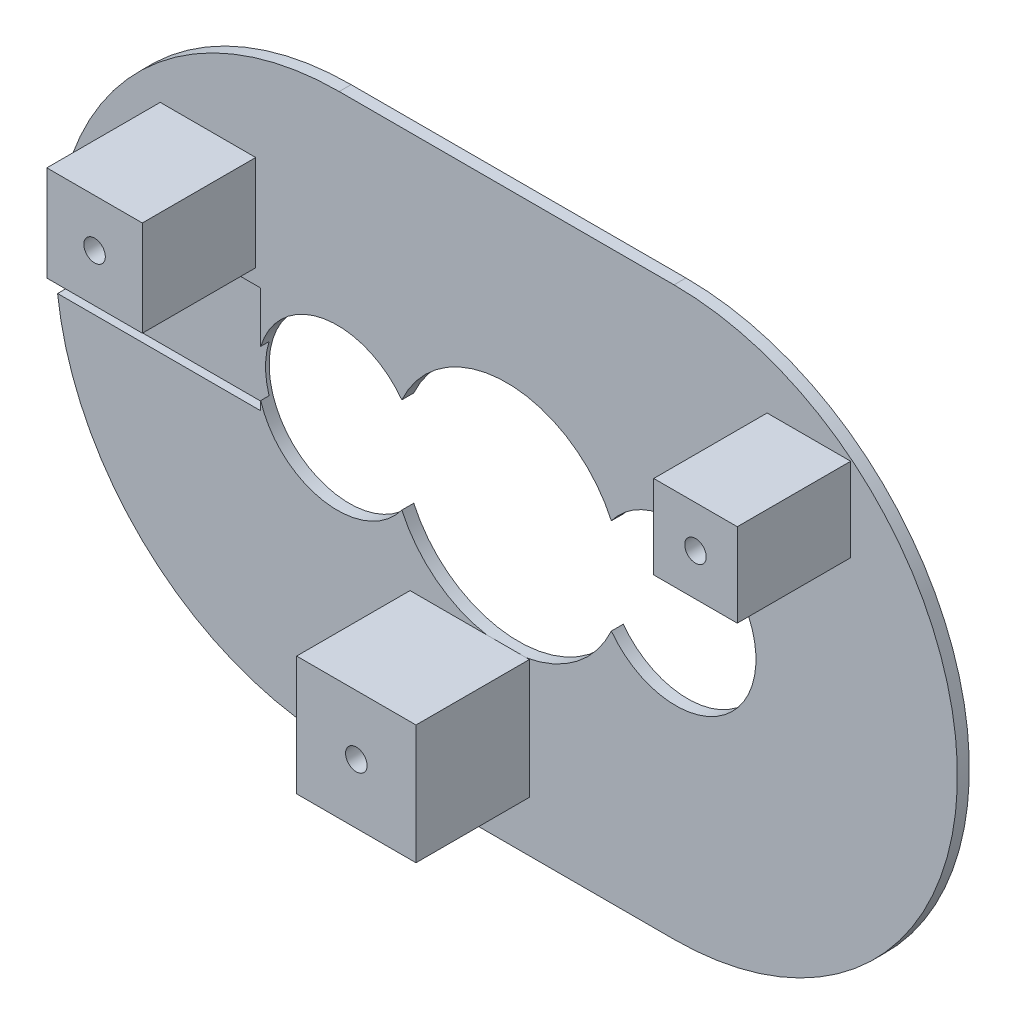
ISO-10303-21;
HEADER;
FILE_DESCRIPTION(('STEP AP214'),'2;1');
FILE_NAME('part.step','',(''),(''),'','','');
FILE_SCHEMA(('AUTOMOTIVE_DESIGN { 1 0 10303 214 1 1 1 1 }'));
ENDSEC;
DATA;
#1=APPLICATION_CONTEXT('core data for automotive mechanical design processes');
#2=APPLICATION_PROTOCOL_DEFINITION('international standard','automotive_design',2000,#1);
#3=PRODUCT_CONTEXT('',#1,'mechanical');
#4=PRODUCT('Part','Part','',(#3));
#5=PRODUCT_RELATED_PRODUCT_CATEGORY('part','',(#4));
#6=PRODUCT_DEFINITION_FORMATION('','',#4);
#7=PRODUCT_DEFINITION_CONTEXT('part definition',#1,'design');
#8=PRODUCT_DEFINITION('design','',#6,#7);
#9=PRODUCT_DEFINITION_SHAPE('','',#8);
#10=(LENGTH_UNIT() NAMED_UNIT(*) SI_UNIT(.MILLI.,.METRE.));
#11=(NAMED_UNIT(*) PLANE_ANGLE_UNIT() SI_UNIT($,.RADIAN.));
#12=(NAMED_UNIT(*) SI_UNIT($,.STERADIAN.) SOLID_ANGLE_UNIT());
#13=UNCERTAINTY_MEASURE_WITH_UNIT(LENGTH_MEASURE(1.E-05),#10,'distance_accuracy_value','');
#14=(GEOMETRIC_REPRESENTATION_CONTEXT(3) GLOBAL_UNCERTAINTY_ASSIGNED_CONTEXT((#13)) GLOBAL_UNIT_ASSIGNED_CONTEXT((#10,
#11,#12)) REPRESENTATION_CONTEXT('',''));
#15=CARTESIAN_POINT('',(0.,0.,0.));
#16=DIRECTION('',(0.,0.,1.));
#17=DIRECTION('',(1.,0.,0.));
#18=AXIS2_PLACEMENT_3D('',#15,#16,#17);
#19=CARTESIAN_POINT('',(0.,0.,1.));
#20=DIRECTION('',(0.,0.,-1.));
#21=DIRECTION('',(-1.,0.,0.));
#22=AXIS2_PLACEMENT_3D('',#19,#20,#21);
#23=CYLINDRICAL_SURFACE('',#22,9.64479785047995);
#24=DIRECTION('',(0.,0.,1.));
#25=VECTOR('',#24,1.);
#26=CARTESIAN_POINT('',(-8.7772747293281,3.99769607430594,5.25));
#27=LINE('',#26,#25);
#28=CARTESIAN_POINT('',(-8.7772747293281,3.99769607430594,0.));
#29=VERTEX_POINT('',#28);
#30=CARTESIAN_POINT('',(-8.7772747293281,3.99769607430594,1.));
#31=VERTEX_POINT('',#30);
#32=EDGE_CURVE('E215',#29,#31,#27,.T.);
#33=ORIENTED_EDGE('',*,*,#32,.F.);
#34=CARTESIAN_POINT('',(0.,0.,0.));
#35=DIRECTION('',(0.,0.,1.));
#36=DIRECTION('',(1.,0.,0.));
#37=AXIS2_PLACEMENT_3D('',#34,#35,#36);
#38=CIRCLE('',#37,9.64479785047995);
#39=CARTESIAN_POINT('',(8.77727472932787,3.99769607430645,0.));
#40=VERTEX_POINT('',#39);
#41=EDGE_CURVE('E227',#40,#29,#38,.T.);
#42=ORIENTED_EDGE('',*,*,#41,.F.);
#43=DIRECTION('',(0.,0.,1.));
#44=VECTOR('',#43,1.);
#45=CARTESIAN_POINT('',(8.77727472932786,3.99769607430645,5.25));
#46=LINE('',#45,#44);
#47=CARTESIAN_POINT('',(8.77727472932786,3.99769607430645,1.));
#48=VERTEX_POINT('',#47);
#49=EDGE_CURVE('E57',#48,#40,#46,.F.);
#50=ORIENTED_EDGE('',*,*,#49,.F.);
#51=CARTESIAN_POINT('',(0.,0.,1.));
#52=DIRECTION('',(0.,0.,1.));
#53=DIRECTION('',(1.,0.,0.));
#54=AXIS2_PLACEMENT_3D('',#51,#52,#53);
#55=CIRCLE('',#54,9.64479785047995);
#56=EDGE_CURVE('E229',#48,#31,#55,.T.);
#57=ORIENTED_EDGE('',*,*,#56,.T.);
#58=EDGE_LOOP('',(#33,#42,#50,#57));
#59=FACE_BOUND('',#58,.T.);
#60=ADVANCED_FACE('F35',(#59),#23,.F.);
#61=CARTESIAN_POINT('',(-20.6,-2.70527352282265,0.3));
#62=DIRECTION('',(1.,0.,0.));
#63=DIRECTION('',(0.,0.,-1.));
#64=AXIS2_PLACEMENT_3D('',#61,#62,#63);
#65=PLANE('',#64);
#66=DIRECTION('',(0.,1.,0.));
#67=VECTOR('',#66,1.);
#68=CARTESIAN_POINT('',(-20.6,-2.70527352282265,0.3));
#69=LINE('',#68,#67);
#70=CARTESIAN_POINT('',(-20.6,1.96488782201215,0.3));
#71=VERTEX_POINT('',#70);
#72=CARTESIAN_POINT('',(-20.6,6.2,0.3));
#73=VERTEX_POINT('',#72);
#74=EDGE_CURVE('E382',#71,#73,#69,.T.);
#75=ORIENTED_EDGE('',*,*,#74,.F.);
#76=DIRECTION('',(0.,0.,1.));
#77=VECTOR('',#76,1.);
#78=CARTESIAN_POINT('',(-20.6,1.96488782201215,0.));
#79=LINE('',#78,#77);
#80=CARTESIAN_POINT('',(-20.6,1.96488782201215,1.));
#81=VERTEX_POINT('',#80);
#82=EDGE_CURVE('E49',#71,#81,#79,.T.);
#83=ORIENTED_EDGE('',*,*,#82,.T.);
#84=DIRECTION('',(0.,1.,0.));
#85=VECTOR('',#84,1.);
#86=CARTESIAN_POINT('',(-20.6,-2.70527352282265,1.));
#87=LINE('',#86,#85);
#88=CARTESIAN_POINT('',(-20.6,6.2,1.));
#89=VERTEX_POINT('',#88);
#90=EDGE_CURVE('E388',#81,#89,#87,.T.);
#91=ORIENTED_EDGE('',*,*,#90,.T.);
#92=DIRECTION('',(0.,0.,1.));
#93=VECTOR('',#92,1.);
#94=CARTESIAN_POINT('',(-20.6,6.2,0.3));
#95=LINE('',#94,#93);
#96=EDGE_CURVE('E369',#73,#89,#95,.T.);
#97=ORIENTED_EDGE('',*,*,#96,.F.);
#98=EDGE_LOOP('',(#75,#83,#91,#97));
#99=FACE_BOUND('',#98,.T.);
#100=ADVANCED_FACE('F462',(#99),#65,.F.);
#101=CARTESIAN_POINT('',(0.,0.,1.));
#102=DIRECTION('',(0.,0.,1.));
#103=DIRECTION('',(1.,0.,0.));
#104=AXIS2_PLACEMENT_3D('',#101,#102,#103);
#105=PLANE('',#104);
#106=CARTESIAN_POINT('',(-14.1760317905712,0.,1.));
#107=DIRECTION('',(0.,0.,1.));
#108=DIRECTION('',(1.,0.,0.));
#109=AXIS2_PLACEMENT_3D('',#106,#107,#108);
#110=CIRCLE('',#109,6.71774900609152);
#111=EDGE_CURVE('E404',#31,#81,#110,.T.);
#112=ORIENTED_EDGE('',*,*,#111,.F.);
#113=ORIENTED_EDGE('',*,*,#56,.F.);
#114=CARTESIAN_POINT('',(14.1760317905711,1.07931585702665E-12,1.));
#115=DIRECTION('',(0.,0.,1.));
#116=DIRECTION('',(1.,0.,0.));
#117=AXIS2_PLACEMENT_3D('',#114,#115,#116);
#118=CIRCLE('',#117,6.71774900609131);
#119=CARTESIAN_POINT('',(8.77727472932847,-3.99769607430511,1.));
#120=VERTEX_POINT('',#119);
#121=EDGE_CURVE('E400',#120,#48,#118,.T.);
#122=ORIENTED_EDGE('',*,*,#121,.F.);
#123=CARTESIAN_POINT('',(1.67896708011091,-9.49753626581792,1.));
#124=VERTEX_POINT('',#123);
#125=EDGE_CURVE('E746',#124,#120,#55,.T.);
#126=ORIENTED_EDGE('',*,*,#125,.F.);
#127=DIRECTION('',(-1.,0.,0.));
#128=VECTOR('',#127,1.);
#129=CARTESIAN_POINT('',(-8.09019812126459,-9.49753626581792,1.));
#130=LINE('',#129,#128);
#131=CARTESIAN_POINT('',(1.90980187873542,-9.49753626581792,1.));
#132=VERTEX_POINT('',#131);
#133=EDGE_CURVE('E263',#132,#124,#130,.T.);
#134=ORIENTED_EDGE('',*,*,#133,.F.);
#135=DIRECTION('',(0.,1.,0.));
#136=VECTOR('',#135,1.);
#137=CARTESIAN_POINT('',(1.90980187873542,-9.49753626581792,1.));
#138=LINE('',#137,#136);
#139=CARTESIAN_POINT('',(1.90980187873542,-19.4975362658179,1.));
#140=VERTEX_POINT('',#139);
#141=EDGE_CURVE('E274',#140,#132,#138,.T.);
#142=ORIENTED_EDGE('',*,*,#141,.F.);
#143=DIRECTION('',(1.,0.,0.));
#144=VECTOR('',#143,1.);
#145=CARTESIAN_POINT('',(-8.09019812126458,-19.4975362658179,1.));
#146=LINE('',#145,#144);
#147=CARTESIAN_POINT('',(-8.09019812126458,-19.4975362658179,1.));
#148=VERTEX_POINT('',#147);
#149=EDGE_CURVE('E293',#148,#140,#146,.T.);
#150=ORIENTED_EDGE('',*,*,#149,.F.);
#151=DIRECTION('',(0.,-1.,0.));
#152=VECTOR('',#151,1.);
#153=CARTESIAN_POINT('',(-8.09019812126459,-9.49753626581792,1.));
#154=LINE('',#153,#152);
#155=CARTESIAN_POINT('',(-8.09019812126459,-9.49753626581792,1.));
#156=VERTEX_POINT('',#155);
#157=EDGE_CURVE('E273',#156,#148,#154,.T.);
#158=ORIENTED_EDGE('',*,*,#157,.F.);
#159=CARTESIAN_POINT('',(-1.67896708011091,-9.49753626581792,1.));
#160=VERTEX_POINT('',#159);
#161=EDGE_CURVE('E260',#160,#156,#130,.T.);
#162=ORIENTED_EDGE('',*,*,#161,.F.);
#163=CARTESIAN_POINT('',(-8.77727472932806,-3.99769607430601,1.));
#164=VERTEX_POINT('',#163);
#165=EDGE_CURVE('E252',#164,#160,#55,.T.);
#166=ORIENTED_EDGE('',*,*,#165,.F.);
#167=CARTESIAN_POINT('',(-20.6,-1.96488782201227,1.));
#168=VERTEX_POINT('',#167);
#169=EDGE_CURVE('E405',#168,#164,#110,.T.);
#170=ORIENTED_EDGE('',*,*,#169,.F.);
#171=CARTESIAN_POINT('',(-20.6,-2.70527352282265,1.));
#172=VERTEX_POINT('',#171);
#173=EDGE_CURVE('E385',#172,#168,#87,.T.);
#174=ORIENTED_EDGE('',*,*,#173,.F.);
#175=DIRECTION('',(1.,0.,0.));
#176=VECTOR('',#175,1.);
#177=CARTESIAN_POINT('',(-37.6176932340753,-2.70527352282266,1.));
#178=LINE('',#177,#176);
#179=CARTESIAN_POINT('',(-37.6176932340753,-2.70527352282265,1.));
#180=VERTEX_POINT('',#179);
#181=EDGE_CURVE('E379',#180,#172,#178,.T.);
#182=ORIENTED_EDGE('',*,*,#181,.F.);
#183=CARTESIAN_POINT('',(-14.0267247510678,0.,1.));
#184=DIRECTION('',(0.,0.,1.));
#185=DIRECTION('',(1.,0.,0.));
#186=AXIS2_PLACEMENT_3D('',#183,#184,#185);
#187=CIRCLE('',#186,23.745574299215);
#188=CARTESIAN_POINT('',(-14.0267247510677,-23.745574299215,1.));
#189=VERTEX_POINT('',#188);
#190=EDGE_CURVE('E427',#180,#189,#187,.T.);
#191=ORIENTED_EDGE('',*,*,#190,.T.);
#192=DIRECTION('',(-1.,0.,0.));
#193=VECTOR('',#192,1.);
#194=CARTESIAN_POINT('',(0.,-23.745574299215,1.));
#195=LINE('',#194,#193);
#196=CARTESIAN_POINT('',(14.0267247510677,-23.745574299215,1.));
#197=VERTEX_POINT('',#196);
#198=EDGE_CURVE('E435',#197,#189,#195,.T.);
#199=ORIENTED_EDGE('',*,*,#198,.F.);
#200=CARTESIAN_POINT('',(14.0267247510678,0.,1.));
#201=DIRECTION('',(0.,0.,1.));
#202=DIRECTION('',(1.,0.,0.));
#203=AXIS2_PLACEMENT_3D('',#200,#201,#202);
#204=CIRCLE('',#203,23.745574299215);
#205=CARTESIAN_POINT('',(14.0267247510677,23.745574299215,1.));
#206=VERTEX_POINT('',#205);
#207=EDGE_CURVE('E241',#197,#206,#204,.T.);
#208=ORIENTED_EDGE('',*,*,#207,.T.);
#209=DIRECTION('',(1.,0.,0.));
#210=VECTOR('',#209,1.);
#211=CARTESIAN_POINT('',(0.,23.7455742992151,1.));
#212=LINE('',#211,#210);
#213=CARTESIAN_POINT('',(-14.0267247510678,23.7455742992151,1.));
#214=VERTEX_POINT('',#213);
#215=EDGE_CURVE('E432',#214,#206,#212,.T.);
#216=ORIENTED_EDGE('',*,*,#215,.F.);
#217=CARTESIAN_POINT('',(-36.9485985575335,6.2,1.));
#218=VERTEX_POINT('',#217);
#219=EDGE_CURVE('E431',#214,#218,#187,.T.);
#220=ORIENTED_EDGE('',*,*,#219,.T.);
#221=DIRECTION('',(-1.,0.,0.));
#222=VECTOR('',#221,1.);
#223=CARTESIAN_POINT('',(-20.6,6.2,1.));
#224=LINE('',#223,#222);
#225=EDGE_CURVE('E383',#89,#218,#224,.T.);
#226=ORIENTED_EDGE('',*,*,#225,.F.);
#227=ORIENTED_EDGE('',*,*,#90,.F.);
#228=EDGE_LOOP('',(#112,#113,#122,#126,#134,#142,#150,#158,#162,#166,#170,#174,#182,#191,#199,
#208,#216,#220,#226,#227));
#229=FACE_BOUND('',#228,.T.);
#230=DIRECTION('',(-1.,0.,0.));
#231=VECTOR('',#230,1.);
#232=CARTESIAN_POINT('',(-29.018703453888,15.4623227443855,1.));
#233=LINE('',#232,#231);
#234=CARTESIAN_POINT('',(-21.018703453888,15.4623227443855,1.));
#235=VERTEX_POINT('',#234);
#236=CARTESIAN_POINT('',(-29.018703453888,15.4623227443855,1.));
#237=VERTEX_POINT('',#236);
#238=EDGE_CURVE('E309',#235,#237,#233,.T.);
#239=ORIENTED_EDGE('',*,*,#238,.F.);
#240=DIRECTION('',(0.,1.,0.));
#241=VECTOR('',#240,1.);
#242=CARTESIAN_POINT('',(-21.018703453888,15.4623227443855,1.));
#243=LINE('',#242,#241);
#244=CARTESIAN_POINT('',(-21.018703453888,7.46232274438552,1.));
#245=VERTEX_POINT('',#244);
#246=EDGE_CURVE('E311',#245,#235,#243,.T.);
#247=ORIENTED_EDGE('',*,*,#246,.F.);
#248=DIRECTION('',(1.,0.,0.));
#249=VECTOR('',#248,1.);
#250=CARTESIAN_POINT('',(-29.018703453888,7.46232274438552,1.));
#251=LINE('',#250,#249);
#252=CARTESIAN_POINT('',(-29.018703453888,7.46232274438552,1.));
#253=VERTEX_POINT('',#252);
#254=EDGE_CURVE('E303',#253,#245,#251,.T.);
#255=ORIENTED_EDGE('',*,*,#254,.F.);
#256=DIRECTION('',(0.,-1.,0.));
#257=VECTOR('',#256,1.);
#258=CARTESIAN_POINT('',(-29.018703453888,15.4623227443855,1.));
#259=LINE('',#258,#257);
#260=EDGE_CURVE('E306',#237,#253,#259,.T.);
#261=ORIENTED_EDGE('',*,*,#260,.F.);
#262=EDGE_LOOP('',(#239,#247,#255,#261));
#263=FACE_BOUND('',#262,.T.);
#264=DIRECTION('',(-1.,0.,0.));
#265=VECTOR('',#264,1.);
#266=CARTESIAN_POINT('',(21.8270906926752,18.3469152336372,1.));
#267=LINE('',#266,#265);
#268=CARTESIAN_POINT('',(28.8270906926752,18.3469152336372,1.));
#269=VERTEX_POINT('',#268);
#270=CARTESIAN_POINT('',(21.8270906926752,18.3469152336372,1.));
#271=VERTEX_POINT('',#270);
#272=EDGE_CURVE('E338',#269,#271,#267,.T.);
#273=ORIENTED_EDGE('',*,*,#272,.F.);
#274=DIRECTION('',(0.,1.,0.));
#275=VECTOR('',#274,1.);
#276=CARTESIAN_POINT('',(28.8270906926752,18.3469152336372,1.));
#277=LINE('',#276,#275);
#278=CARTESIAN_POINT('',(28.8270906926752,11.3469152336372,1.));
#279=VERTEX_POINT('',#278);
#280=EDGE_CURVE('E340',#279,#269,#277,.T.);
#281=ORIENTED_EDGE('',*,*,#280,.F.);
#282=DIRECTION('',(1.,0.,0.));
#283=VECTOR('',#282,1.);
#284=CARTESIAN_POINT('',(21.8270906926752,11.3469152336372,1.));
#285=LINE('',#284,#283);
#286=CARTESIAN_POINT('',(21.8270906926752,11.3469152336372,1.));
#287=VERTEX_POINT('',#286);
#288=EDGE_CURVE('E332',#287,#279,#285,.T.);
#289=ORIENTED_EDGE('',*,*,#288,.F.);
#290=DIRECTION('',(0.,-1.,0.));
#291=VECTOR('',#290,1.);
#292=CARTESIAN_POINT('',(21.8270906926752,18.3469152336372,1.));
#293=LINE('',#292,#291);
#294=EDGE_CURVE('E335',#271,#287,#293,.T.);
#295=ORIENTED_EDGE('',*,*,#294,.F.);
#296=EDGE_LOOP('',(#273,#281,#289,#295));
#297=FACE_BOUND('',#296,.T.);
#298=ADVANCED_FACE('F444',(#229,#263,#297),#105,.T.);
#299=CARTESIAN_POINT('',(0.,23.7455742992151,1.));
#300=DIRECTION('',(0.,1.,0.));
#301=DIRECTION('',(-1.,0.,0.));
#302=AXIS2_PLACEMENT_3D('',#299,#300,#301);
#303=PLANE('',#302);
#304=DIRECTION('',(1.,0.,0.));
#305=VECTOR('',#304,1.);
#306=CARTESIAN_POINT('',(0.,23.7455742992151,0.));
#307=LINE('',#306,#305);
#308=CARTESIAN_POINT('',(-14.0267247510678,23.7455742992151,0.));
#309=VERTEX_POINT('',#308);
#310=CARTESIAN_POINT('',(14.0267247510677,23.745574299215,0.));
#311=VERTEX_POINT('',#310);
#312=EDGE_CURVE('E233',#309,#311,#307,.T.);
#313=ORIENTED_EDGE('',*,*,#312,.F.);
#314=DIRECTION('',(0.,0.,-1.));
#315=VECTOR('',#314,1.);
#316=CARTESIAN_POINT('',(-14.0267247510678,23.7455742992151,1.));
#317=LINE('',#316,#315);
#318=EDGE_CURVE('E259',#214,#309,#317,.T.);
#319=ORIENTED_EDGE('',*,*,#318,.F.);
#320=ORIENTED_EDGE('',*,*,#215,.T.);
#321=DIRECTION('',(0.,0.,-1.));
#322=VECTOR('',#321,1.);
#323=CARTESIAN_POINT('',(14.0267247510677,23.745574299215,1.));
#324=LINE('',#323,#322);
#325=EDGE_CURVE('E253',#206,#311,#324,.T.);
#326=ORIENTED_EDGE('',*,*,#325,.T.);
#327=EDGE_LOOP('',(#313,#319,#320,#326));
#328=FACE_BOUND('',#327,.T.);
#329=ADVANCED_FACE('F451',(#328),#303,.T.);
#330=CARTESIAN_POINT('',(-14.0267247510678,0.,1.));
#331=DIRECTION('',(0.,0.,-1.));
#332=DIRECTION('',(-1.,0.,0.));
#333=AXIS2_PLACEMENT_3D('',#330,#331,#332);
#334=CYLINDRICAL_SURFACE('',#333,23.745574299215);
#335=ORIENTED_EDGE('',*,*,#190,.F.);
#336=DIRECTION('',(0.,0.,1.));
#337=VECTOR('',#336,1.);
#338=CARTESIAN_POINT('',(-37.6176932340753,-2.70527352282265,0.3));
#339=LINE('',#338,#337);
#340=CARTESIAN_POINT('',(-37.6176932340753,-2.70527352282265,0.3));
#341=VERTEX_POINT('',#340);
#342=EDGE_CURVE('E376',#341,#180,#339,.T.);
#343=ORIENTED_EDGE('',*,*,#342,.F.);
#344=CARTESIAN_POINT('',(-14.0267247510678,0.,0.3));
#345=DIRECTION('',(0.,0.,1.));
#346=DIRECTION('',(1.,0.,0.));
#347=AXIS2_PLACEMENT_3D('',#344,#345,#346);
#348=CIRCLE('',#347,23.745574299215);
#349=CARTESIAN_POINT('',(-36.9485985575335,6.20000000000001,0.3));
#350=VERTEX_POINT('',#349);
#351=EDGE_CURVE('E391',#350,#341,#348,.T.);
#352=ORIENTED_EDGE('',*,*,#351,.F.);
#353=DIRECTION('',(0.,0.,1.));
#354=VECTOR('',#353,1.);
#355=CARTESIAN_POINT('',(-36.9485985575335,6.2,0.3));
#356=LINE('',#355,#354);
#357=EDGE_CURVE('E372',#350,#218,#356,.T.);
#358=ORIENTED_EDGE('',*,*,#357,.T.);
#359=ORIENTED_EDGE('',*,*,#219,.F.);
#360=ORIENTED_EDGE('',*,*,#318,.T.);
#361=CARTESIAN_POINT('',(-14.0267247510678,0.,0.));
#362=DIRECTION('',(0.,0.,1.));
#363=DIRECTION('',(1.,0.,0.));
#364=AXIS2_PLACEMENT_3D('',#361,#362,#363);
#365=CIRCLE('',#364,23.745574299215);
#366=CARTESIAN_POINT('',(-14.0267247510677,-23.745574299215,0.));
#367=VERTEX_POINT('',#366);
#368=EDGE_CURVE('E237',#309,#367,#365,.T.);
#369=ORIENTED_EDGE('',*,*,#368,.T.);
#370=DIRECTION('',(0.,0.,-1.));
#371=VECTOR('',#370,1.);
#372=CARTESIAN_POINT('',(-14.0267247510677,-23.745574299215,1.));
#373=LINE('',#372,#371);
#374=EDGE_CURVE('E257',#189,#367,#373,.T.);
#375=ORIENTED_EDGE('',*,*,#374,.F.);
#376=EDGE_LOOP('',(#335,#343,#352,#358,#359,#360,#369,#375));
#377=FACE_BOUND('',#376,.T.);
#378=ADVANCED_FACE('F425',(#377),#334,.T.);
#379=CARTESIAN_POINT('',(0.,-23.745574299215,1.));
#380=DIRECTION('',(0.,-1.,0.));
#381=DIRECTION('',(0.,0.,-1.));
#382=AXIS2_PLACEMENT_3D('',#379,#380,#381);
#383=PLANE('',#382);
#384=DIRECTION('',(-1.,0.,0.));
#385=VECTOR('',#384,1.);
#386=CARTESIAN_POINT('',(0.,-23.745574299215,0.));
#387=LINE('',#386,#385);
#388=CARTESIAN_POINT('',(14.0267247510677,-23.745574299215,0.));
#389=VERTEX_POINT('',#388);
#390=EDGE_CURVE('E246',#389,#367,#387,.T.);
#391=ORIENTED_EDGE('',*,*,#390,.F.);
#392=DIRECTION('',(0.,0.,-1.));
#393=VECTOR('',#392,1.);
#394=CARTESIAN_POINT('',(14.0267247510677,-23.745574299215,1.));
#395=LINE('',#394,#393);
#396=EDGE_CURVE('E255',#197,#389,#395,.T.);
#397=ORIENTED_EDGE('',*,*,#396,.F.);
#398=ORIENTED_EDGE('',*,*,#198,.T.);
#399=ORIENTED_EDGE('',*,*,#374,.T.);
#400=EDGE_LOOP('',(#391,#397,#398,#399));
#401=FACE_BOUND('',#400,.T.);
#402=ADVANCED_FACE('F569',(#401),#383,.T.);
#403=DIRECTION('',(0.,0.,1.));
#404=VECTOR('',#403,1.);
#405=CARTESIAN_POINT('',(-8.77727472932806,-3.99769607430601,5.25));
#406=LINE('',#405,#404);
#407=CARTESIAN_POINT('',(-8.77727472932806,-3.99769607430601,0.));
#408=VERTEX_POINT('',#407);
#409=EDGE_CURVE('E218',#164,#408,#406,.F.);
#410=ORIENTED_EDGE('',*,*,#409,.F.);
#411=ORIENTED_EDGE('',*,*,#165,.T.);
#412=EDGE_CURVE('E437',#160,#124,#55,.T.);
#413=ORIENTED_EDGE('',*,*,#412,.T.);
#414=ORIENTED_EDGE('',*,*,#125,.T.);
#415=DIRECTION('',(0.,0.,1.));
#416=VECTOR('',#415,1.);
#417=CARTESIAN_POINT('',(8.77727472932847,-3.99769607430512,5.25));
#418=LINE('',#417,#416);
#419=CARTESIAN_POINT('',(8.77727472932847,-3.99769607430511,0.));
#420=VERTEX_POINT('',#419);
#421=EDGE_CURVE('E398',#420,#120,#418,.T.);
#422=ORIENTED_EDGE('',*,*,#421,.F.);
#423=EDGE_CURVE('E234',#408,#420,#38,.T.);
#424=ORIENTED_EDGE('',*,*,#423,.F.);
#425=EDGE_LOOP('',(#410,#411,#413,#414,#422,#424));
#426=FACE_BOUND('',#425,.T.);
#427=ADVANCED_FACE('F37',(#426),#23,.F.);
#428=CARTESIAN_POINT('',(14.0267247510678,0.,1.));
#429=DIRECTION('',(0.,0.,-1.));
#430=DIRECTION('',(-1.,0.,0.));
#431=AXIS2_PLACEMENT_3D('',#428,#429,#430);
#432=CYLINDRICAL_SURFACE('',#431,23.745574299215);
#433=CARTESIAN_POINT('',(14.0267247510678,0.,0.));
#434=DIRECTION('',(0.,0.,1.));
#435=DIRECTION('',(1.,0.,0.));
#436=AXIS2_PLACEMENT_3D('',#433,#434,#435);
#437=CIRCLE('',#436,23.745574299215);
#438=EDGE_CURVE('E249',#389,#311,#437,.T.);
#439=ORIENTED_EDGE('',*,*,#438,.T.);
#440=ORIENTED_EDGE('',*,*,#325,.F.);
#441=ORIENTED_EDGE('',*,*,#207,.F.);
#442=ORIENTED_EDGE('',*,*,#396,.T.);
#443=EDGE_LOOP('',(#439,#440,#441,#442));
#444=FACE_BOUND('',#443,.T.);
#445=ADVANCED_FACE('F447',(#444),#432,.T.);
#446=CARTESIAN_POINT('',(0.,0.,0.));
#447=DIRECTION('',(0.,0.,1.));
#448=DIRECTION('',(1.,0.,0.));
#449=AXIS2_PLACEMENT_3D('',#446,#447,#448);
#450=PLANE('',#449);
#451=ORIENTED_EDGE('',*,*,#41,.T.);
#452=CARTESIAN_POINT('',(-14.1760317905712,0.,0.));
#453=DIRECTION('',(0.,0.,1.));
#454=DIRECTION('',(1.,0.,0.));
#455=AXIS2_PLACEMENT_3D('',#452,#453,#454);
#456=CIRCLE('',#455,6.71774900609152);
#457=EDGE_CURVE('E212',#29,#408,#456,.T.);
#458=ORIENTED_EDGE('',*,*,#457,.T.);
#459=ORIENTED_EDGE('',*,*,#423,.T.);
#460=CARTESIAN_POINT('',(14.1760317905711,1.07931585702665E-12,0.));
#461=DIRECTION('',(0.,0.,1.));
#462=DIRECTION('',(1.,0.,0.));
#463=AXIS2_PLACEMENT_3D('',#460,#461,#462);
#464=CIRCLE('',#463,6.71774900609131);
#465=EDGE_CURVE('E43',#420,#40,#464,.T.);
#466=ORIENTED_EDGE('',*,*,#465,.T.);
#467=EDGE_LOOP('',(#451,#458,#459,#466));
#468=FACE_BOUND('',#467,.T.);
#469=ORIENTED_EDGE('',*,*,#312,.T.);
#470=ORIENTED_EDGE('',*,*,#438,.F.);
#471=ORIENTED_EDGE('',*,*,#390,.T.);
#472=ORIENTED_EDGE('',*,*,#368,.F.);
#473=EDGE_LOOP('',(#469,#470,#471,#472));
#474=FACE_BOUND('',#473,.T.);
#475=ADVANCED_FACE('F231',(#468,#474),#450,.F.);
#476=CARTESIAN_POINT('',(1.90980187873542,-9.49753626581792,10.5));
#477=DIRECTION('',(-1.,0.,0.));
#478=DIRECTION('',(0.,-1.,0.));
#479=AXIS2_PLACEMENT_3D('',#476,#477,#478);
#480=PLANE('',#479);
#481=ORIENTED_EDGE('',*,*,#141,.T.);
#482=DIRECTION('',(0.,0.,-1.));
#483=VECTOR('',#482,1.);
#484=CARTESIAN_POINT('',(1.90980187873542,-9.49753626581792,10.5));
#485=LINE('',#484,#483);
#486=CARTESIAN_POINT('',(1.90980187873542,-9.49753626581792,10.5));
#487=VERTEX_POINT('',#486);
#488=EDGE_CURVE('E239',#487,#132,#485,.T.);
#489=ORIENTED_EDGE('',*,*,#488,.F.);
#490=DIRECTION('',(0.,1.,0.));
#491=VECTOR('',#490,1.);
#492=CARTESIAN_POINT('',(1.90980187873542,-9.49753626581792,10.5));
#493=LINE('',#492,#491);
#494=CARTESIAN_POINT('',(1.90980187873542,-19.4975362658179,10.5));
#495=VERTEX_POINT('',#494);
#496=EDGE_CURVE('E291',#495,#487,#493,.T.);
#497=ORIENTED_EDGE('',*,*,#496,.F.);
#498=DIRECTION('',(0.,0.,-1.));
#499=VECTOR('',#498,1.);
#500=CARTESIAN_POINT('',(1.90980187873542,-19.4975362658179,10.5));
#501=LINE('',#500,#499);
#502=EDGE_CURVE('E286',#495,#140,#501,.T.);
#503=ORIENTED_EDGE('',*,*,#502,.T.);
#504=EDGE_LOOP('',(#481,#489,#497,#503));
#505=FACE_BOUND('',#504,.T.);
#506=ADVANCED_FACE('F562',(#505),#480,.F.);
#507=CARTESIAN_POINT('',(-8.09019812126459,-9.49753626581792,10.5));
#508=DIRECTION('',(0.,-1.,0.));
#509=DIRECTION('',(0.,0.,-1.));
#510=AXIS2_PLACEMENT_3D('',#507,#508,#509);
#511=PLANE('',#510);
#512=ORIENTED_EDGE('',*,*,#133,.T.);
#513=EDGE_CURVE('E264',#124,#160,#130,.T.);
#514=ORIENTED_EDGE('',*,*,#513,.T.);
#515=ORIENTED_EDGE('',*,*,#161,.T.);
#516=DIRECTION('',(0.,0.,-1.));
#517=VECTOR('',#516,1.);
#518=CARTESIAN_POINT('',(-8.09019812126459,-9.49753626581792,10.5));
#519=LINE('',#518,#517);
#520=CARTESIAN_POINT('',(-8.09019812126459,-9.49753626581792,10.5));
#521=VERTEX_POINT('',#520);
#522=EDGE_CURVE('E752',#521,#156,#519,.T.);
#523=ORIENTED_EDGE('',*,*,#522,.F.);
#524=DIRECTION('',(-1.,0.,0.));
#525=VECTOR('',#524,1.);
#526=CARTESIAN_POINT('',(-8.09019812126459,-9.49753626581792,10.5));
#527=LINE('',#526,#525);
#528=EDGE_CURVE('E289',#487,#521,#527,.T.);
#529=ORIENTED_EDGE('',*,*,#528,.F.);
#530=ORIENTED_EDGE('',*,*,#488,.T.);
#531=EDGE_LOOP('',(#512,#514,#515,#523,#529,#530));
#532=FACE_BOUND('',#531,.T.);
#533=ADVANCED_FACE('F558',(#532),#511,.F.);
#534=CARTESIAN_POINT('',(-8.09019812126459,-9.49753626581792,10.5));
#535=DIRECTION('',(1.,0.,0.));
#536=DIRECTION('',(0.,1.,0.));
#537=AXIS2_PLACEMENT_3D('',#534,#535,#536);
#538=PLANE('',#537);
#539=ORIENTED_EDGE('',*,*,#157,.T.);
#540=DIRECTION('',(0.,0.,-1.));
#541=VECTOR('',#540,1.);
#542=CARTESIAN_POINT('',(-8.09019812126458,-19.4975362658179,10.5));
#543=LINE('',#542,#541);
#544=CARTESIAN_POINT('',(-8.09019812126458,-19.4975362658179,10.5));
#545=VERTEX_POINT('',#544);
#546=EDGE_CURVE('E754',#545,#148,#543,.T.);
#547=ORIENTED_EDGE('',*,*,#546,.F.);
#548=DIRECTION('',(0.,-1.,0.));
#549=VECTOR('',#548,1.);
#550=CARTESIAN_POINT('',(-8.09019812126459,-9.49753626581792,10.5));
#551=LINE('',#550,#549);
#552=EDGE_CURVE('E287',#521,#545,#551,.T.);
#553=ORIENTED_EDGE('',*,*,#552,.F.);
#554=ORIENTED_EDGE('',*,*,#522,.T.);
#555=EDGE_LOOP('',(#539,#547,#553,#554));
#556=FACE_BOUND('',#555,.T.);
#557=ADVANCED_FACE('F554',(#556),#538,.F.);
#558=CARTESIAN_POINT('',(-8.09019812126458,-19.4975362658179,10.5));
#559=DIRECTION('',(0.,1.,0.));
#560=DIRECTION('',(0.,0.,1.));
#561=AXIS2_PLACEMENT_3D('',#558,#559,#560);
#562=PLANE('',#561);
#563=ORIENTED_EDGE('',*,*,#149,.T.);
#564=ORIENTED_EDGE('',*,*,#502,.F.);
#565=DIRECTION('',(1.,0.,0.));
#566=VECTOR('',#565,1.);
#567=CARTESIAN_POINT('',(-8.09019812126458,-19.4975362658179,10.5));
#568=LINE('',#567,#566);
#569=EDGE_CURVE('E284',#545,#495,#568,.T.);
#570=ORIENTED_EDGE('',*,*,#569,.F.);
#571=ORIENTED_EDGE('',*,*,#546,.T.);
#572=EDGE_LOOP('',(#563,#564,#570,#571));
#573=FACE_BOUND('',#572,.T.);
#574=ADVANCED_FACE('F547',(#573),#562,.F.);
#575=CARTESIAN_POINT('',(0.,0.,10.5));
#576=DIRECTION('',(0.,0.,1.));
#577=DIRECTION('',(1.,0.,0.));
#578=AXIS2_PLACEMENT_3D('',#575,#576,#577);
#579=PLANE('',#578);
#580=CARTESIAN_POINT('',(-3.09019812126458,-14.4975362658179,10.5));
#581=DIRECTION('',(0.,0.,1.));
#582=DIRECTION('',(1.,0.,0.));
#583=AXIS2_PLACEMENT_3D('',#580,#581,#582);
#584=CIRCLE('',#583,0.9);
#585=CARTESIAN_POINT('',(-2.19019812126458,-14.4975362658179,10.5));
#586=VERTEX_POINT('',#585);
#587=EDGE_CURVE('E363',#586,#586,#584,.T.);
#588=ORIENTED_EDGE('',*,*,#587,.F.);
#589=EDGE_LOOP('',(#588));
#590=FACE_BOUND('',#589,.T.);
#591=ORIENTED_EDGE('',*,*,#496,.T.);
#592=ORIENTED_EDGE('',*,*,#528,.T.);
#593=ORIENTED_EDGE('',*,*,#552,.T.);
#594=ORIENTED_EDGE('',*,*,#569,.T.);
#595=EDGE_LOOP('',(#591,#592,#593,#594));
#596=FACE_BOUND('',#595,.T.);
#597=ADVANCED_FACE('F544',(#590,#596),#579,.T.);
#598=CARTESIAN_POINT('',(0.,0.,1.));
#599=DIRECTION('',(0.,0.,1.));
#600=DIRECTION('',(1.,0.,0.));
#601=AXIS2_PLACEMENT_3D('',#598,#599,#600);
#602=PLANE('',#601);
#603=ORIENTED_EDGE('',*,*,#412,.F.);
#604=ORIENTED_EDGE('',*,*,#513,.F.);
#605=EDGE_LOOP('',(#603,#604));
#606=FACE_BOUND('',#605,.T.);
#607=ADVANCED_FACE('F542',(#606),#602,.F.);
#608=CARTESIAN_POINT('',(-21.018703453888,15.4623227443855,10.5));
#609=DIRECTION('',(-1.,0.,0.));
#610=DIRECTION('',(0.,-1.,0.));
#611=AXIS2_PLACEMENT_3D('',#608,#609,#610);
#612=PLANE('',#611);
#613=ORIENTED_EDGE('',*,*,#246,.T.);
#614=DIRECTION('',(0.,0.,-1.));
#615=VECTOR('',#614,1.);
#616=CARTESIAN_POINT('',(-21.018703453888,15.4623227443855,10.5));
#617=LINE('',#616,#615);
#618=CARTESIAN_POINT('',(-21.018703453888,15.4623227443855,10.5));
#619=VERTEX_POINT('',#618);
#620=EDGE_CURVE('E277',#619,#235,#617,.T.);
#621=ORIENTED_EDGE('',*,*,#620,.F.);
#622=DIRECTION('',(0.,1.,0.));
#623=VECTOR('',#622,1.);
#624=CARTESIAN_POINT('',(-21.018703453888,15.4623227443855,10.5));
#625=LINE('',#624,#623);
#626=CARTESIAN_POINT('',(-21.018703453888,7.46232274438552,10.5));
#627=VERTEX_POINT('',#626);
#628=EDGE_CURVE('E305',#627,#619,#625,.T.);
#629=ORIENTED_EDGE('',*,*,#628,.F.);
#630=DIRECTION('',(0.,0.,-1.));
#631=VECTOR('',#630,1.);
#632=CARTESIAN_POINT('',(-21.018703453888,7.46232274438552,10.5));
#633=LINE('',#632,#631);
#634=EDGE_CURVE('E299',#627,#245,#633,.T.);
#635=ORIENTED_EDGE('',*,*,#634,.T.);
#636=EDGE_LOOP('',(#613,#621,#629,#635));
#637=FACE_BOUND('',#636,.T.);
#638=ADVANCED_FACE('F538',(#637),#612,.F.);
#639=CARTESIAN_POINT('',(-29.018703453888,15.4623227443855,10.5));
#640=DIRECTION('',(0.,-1.,0.));
#641=DIRECTION('',(0.,0.,-1.));
#642=AXIS2_PLACEMENT_3D('',#639,#640,#641);
#643=PLANE('',#642);
#644=ORIENTED_EDGE('',*,*,#238,.T.);
#645=DIRECTION('',(0.,0.,-1.));
#646=VECTOR('',#645,1.);
#647=CARTESIAN_POINT('',(-29.018703453888,15.4623227443855,10.5));
#648=LINE('',#647,#646);
#649=CARTESIAN_POINT('',(-29.018703453888,15.4623227443855,10.5));
#650=VERTEX_POINT('',#649);
#651=EDGE_CURVE('E281',#650,#237,#648,.T.);
#652=ORIENTED_EDGE('',*,*,#651,.F.);
#653=DIRECTION('',(-1.,0.,0.));
#654=VECTOR('',#653,1.);
#655=CARTESIAN_POINT('',(-29.018703453888,15.4623227443855,10.5));
#656=LINE('',#655,#654);
#657=EDGE_CURVE('E318',#619,#650,#656,.T.);
#658=ORIENTED_EDGE('',*,*,#657,.F.);
#659=ORIENTED_EDGE('',*,*,#620,.T.);
#660=EDGE_LOOP('',(#644,#652,#658,#659));
#661=FACE_BOUND('',#660,.T.);
#662=ADVANCED_FACE('F534',(#661),#643,.F.);
#663=CARTESIAN_POINT('',(-29.018703453888,15.4623227443855,10.5));
#664=DIRECTION('',(1.,0.,0.));
#665=DIRECTION('',(0.,0.,-1.));
#666=AXIS2_PLACEMENT_3D('',#663,#664,#665);
#667=PLANE('',#666);
#668=ORIENTED_EDGE('',*,*,#260,.T.);
#669=DIRECTION('',(0.,0.,-1.));
#670=VECTOR('',#669,1.);
#671=CARTESIAN_POINT('',(-29.018703453888,7.46232274438552,10.5));
#672=LINE('',#671,#670);
#673=CARTESIAN_POINT('',(-29.018703453888,7.46232274438552,10.5));
#674=VERTEX_POINT('',#673);
#675=EDGE_CURVE('E297',#674,#253,#672,.T.);
#676=ORIENTED_EDGE('',*,*,#675,.F.);
#677=DIRECTION('',(0.,-1.,0.));
#678=VECTOR('',#677,1.);
#679=CARTESIAN_POINT('',(-29.018703453888,15.4623227443855,10.5));
#680=LINE('',#679,#678);
#681=EDGE_CURVE('E316',#650,#674,#680,.T.);
#682=ORIENTED_EDGE('',*,*,#681,.F.);
#683=ORIENTED_EDGE('',*,*,#651,.T.);
#684=EDGE_LOOP('',(#668,#676,#682,#683));
#685=FACE_BOUND('',#684,.T.);
#686=ADVANCED_FACE('F530',(#685),#667,.F.);
#687=CARTESIAN_POINT('',(-29.018703453888,7.46232274438552,10.5));
#688=DIRECTION('',(0.,1.,0.));
#689=DIRECTION('',(0.,0.,1.));
#690=AXIS2_PLACEMENT_3D('',#687,#688,#689);
#691=PLANE('',#690);
#692=ORIENTED_EDGE('',*,*,#254,.T.);
#693=ORIENTED_EDGE('',*,*,#634,.F.);
#694=DIRECTION('',(1.,0.,0.));
#695=VECTOR('',#694,1.);
#696=CARTESIAN_POINT('',(-29.018703453888,7.46232274438552,10.5));
#697=LINE('',#696,#695);
#698=EDGE_CURVE('E302',#674,#627,#697,.T.);
#699=ORIENTED_EDGE('',*,*,#698,.F.);
#700=ORIENTED_EDGE('',*,*,#675,.T.);
#701=EDGE_LOOP('',(#692,#693,#699,#700));
#702=FACE_BOUND('',#701,.T.);
#703=ADVANCED_FACE('F526',(#702),#691,.F.);
#704=CARTESIAN_POINT('',(0.,0.,10.5));
#705=DIRECTION('',(0.,0.,1.));
#706=DIRECTION('',(1.,0.,0.));
#707=AXIS2_PLACEMENT_3D('',#704,#705,#706);
#708=PLANE('',#707);
#709=CARTESIAN_POINT('',(-25.018703453888,11.4623227443855,10.5));
#710=DIRECTION('',(0.,0.,1.));
#711=DIRECTION('',(1.,0.,0.));
#712=AXIS2_PLACEMENT_3D('',#709,#710,#711);
#713=CIRCLE('',#712,0.9);
#714=CARTESIAN_POINT('',(-24.118703453888,11.4623227443855,10.5));
#715=VERTEX_POINT('',#714);
#716=EDGE_CURVE('E351',#715,#715,#713,.T.);
#717=ORIENTED_EDGE('',*,*,#716,.F.);
#718=EDGE_LOOP('',(#717));
#719=FACE_BOUND('',#718,.T.);
#720=ORIENTED_EDGE('',*,*,#628,.T.);
#721=ORIENTED_EDGE('',*,*,#657,.T.);
#722=ORIENTED_EDGE('',*,*,#681,.T.);
#723=ORIENTED_EDGE('',*,*,#698,.T.);
#724=EDGE_LOOP('',(#720,#721,#722,#723));
#725=FACE_BOUND('',#724,.T.);
#726=ADVANCED_FACE('F522',(#719,#725),#708,.T.);
#727=CARTESIAN_POINT('',(28.8270906926752,18.3469152336372,10.5));
#728=DIRECTION('',(-1.,0.,0.));
#729=DIRECTION('',(0.,0.,1.));
#730=AXIS2_PLACEMENT_3D('',#727,#728,#729);
#731=PLANE('',#730);
#732=ORIENTED_EDGE('',*,*,#280,.T.);
#733=DIRECTION('',(0.,0.,-1.));
#734=VECTOR('',#733,1.);
#735=CARTESIAN_POINT('',(28.8270906926752,18.3469152336372,10.5));
#736=LINE('',#735,#734);
#737=CARTESIAN_POINT('',(28.8270906926752,18.3469152336372,10.5));
#738=VERTEX_POINT('',#737);
#739=EDGE_CURVE('E314',#738,#269,#736,.T.);
#740=ORIENTED_EDGE('',*,*,#739,.F.);
#741=DIRECTION('',(0.,1.,0.));
#742=VECTOR('',#741,1.);
#743=CARTESIAN_POINT('',(28.8270906926752,18.3469152336372,10.5));
#744=LINE('',#743,#742);
#745=CARTESIAN_POINT('',(28.8270906926752,11.3469152336372,10.5));
#746=VERTEX_POINT('',#745);
#747=EDGE_CURVE('E334',#746,#738,#744,.T.);
#748=ORIENTED_EDGE('',*,*,#747,.F.);
#749=DIRECTION('',(0.,0.,-1.));
#750=VECTOR('',#749,1.);
#751=CARTESIAN_POINT('',(28.8270906926752,11.3469152336372,10.5));
#752=LINE('',#751,#750);
#753=EDGE_CURVE('E328',#746,#279,#752,.T.);
#754=ORIENTED_EDGE('',*,*,#753,.T.);
#755=EDGE_LOOP('',(#732,#740,#748,#754));
#756=FACE_BOUND('',#755,.T.);
#757=ADVANCED_FACE('F518',(#756),#731,.F.);
#758=CARTESIAN_POINT('',(21.8270906926752,18.3469152336372,10.5));
#759=DIRECTION('',(0.,-1.,0.));
#760=DIRECTION('',(0.,0.,-1.));
#761=AXIS2_PLACEMENT_3D('',#758,#759,#760);
#762=PLANE('',#761);
#763=ORIENTED_EDGE('',*,*,#272,.T.);
#764=DIRECTION('',(0.,0.,-1.));
#765=VECTOR('',#764,1.);
#766=CARTESIAN_POINT('',(21.8270906926752,18.3469152336372,10.5));
#767=LINE('',#766,#765);
#768=CARTESIAN_POINT('',(21.8270906926752,18.3469152336372,10.5));
#769=VERTEX_POINT('',#768);
#770=EDGE_CURVE('E323',#769,#271,#767,.T.);
#771=ORIENTED_EDGE('',*,*,#770,.F.);
#772=DIRECTION('',(-1.,0.,0.));
#773=VECTOR('',#772,1.);
#774=CARTESIAN_POINT('',(21.8270906926752,18.3469152336372,10.5));
#775=LINE('',#774,#773);
#776=EDGE_CURVE('E347',#738,#769,#775,.T.);
#777=ORIENTED_EDGE('',*,*,#776,.F.);
#778=ORIENTED_EDGE('',*,*,#739,.T.);
#779=EDGE_LOOP('',(#763,#771,#777,#778));
#780=FACE_BOUND('',#779,.T.);
#781=ADVANCED_FACE('F514',(#780),#762,.F.);
#782=CARTESIAN_POINT('',(21.8270906926752,18.3469152336372,10.5));
#783=DIRECTION('',(1.,0.,0.));
#784=DIRECTION('',(0.,0.,-1.));
#785=AXIS2_PLACEMENT_3D('',#782,#783,#784);
#786=PLANE('',#785);
#787=ORIENTED_EDGE('',*,*,#294,.T.);
#788=DIRECTION('',(0.,0.,-1.));
#789=VECTOR('',#788,1.);
#790=CARTESIAN_POINT('',(21.8270906926752,11.3469152336372,10.5));
#791=LINE('',#790,#789);
#792=CARTESIAN_POINT('',(21.8270906926752,11.3469152336372,10.5));
#793=VERTEX_POINT('',#792);
#794=EDGE_CURVE('E326',#793,#287,#791,.T.);
#795=ORIENTED_EDGE('',*,*,#794,.F.);
#796=DIRECTION('',(0.,-1.,0.));
#797=VECTOR('',#796,1.);
#798=CARTESIAN_POINT('',(21.8270906926752,18.3469152336372,10.5));
#799=LINE('',#798,#797);
#800=EDGE_CURVE('E345',#769,#793,#799,.T.);
#801=ORIENTED_EDGE('',*,*,#800,.F.);
#802=ORIENTED_EDGE('',*,*,#770,.T.);
#803=EDGE_LOOP('',(#787,#795,#801,#802));
#804=FACE_BOUND('',#803,.T.);
#805=ADVANCED_FACE('F510',(#804),#786,.F.);
#806=CARTESIAN_POINT('',(21.8270906926752,11.3469152336372,10.5));
#807=DIRECTION('',(0.,1.,0.));
#808=DIRECTION('',(0.,0.,1.));
#809=AXIS2_PLACEMENT_3D('',#806,#807,#808);
#810=PLANE('',#809);
#811=ORIENTED_EDGE('',*,*,#288,.T.);
#812=ORIENTED_EDGE('',*,*,#753,.F.);
#813=DIRECTION('',(1.,0.,0.));
#814=VECTOR('',#813,1.);
#815=CARTESIAN_POINT('',(21.8270906926752,11.3469152336372,10.5));
#816=LINE('',#815,#814);
#817=EDGE_CURVE('E331',#793,#746,#816,.T.);
#818=ORIENTED_EDGE('',*,*,#817,.F.);
#819=ORIENTED_EDGE('',*,*,#794,.T.);
#820=EDGE_LOOP('',(#811,#812,#818,#819));
#821=FACE_BOUND('',#820,.T.);
#822=ADVANCED_FACE('F506',(#821),#810,.F.);
#823=CARTESIAN_POINT('',(0.,0.,10.5));
#824=DIRECTION('',(0.,0.,1.));
#825=DIRECTION('',(1.,0.,0.));
#826=AXIS2_PLACEMENT_3D('',#823,#824,#825);
#827=PLANE('',#826);
#828=CARTESIAN_POINT('',(25.3270906926752,14.8469152336372,10.5));
#829=DIRECTION('',(0.,0.,1.));
#830=DIRECTION('',(1.,0.,0.));
#831=AXIS2_PLACEMENT_3D('',#828,#829,#830);
#832=CIRCLE('',#831,0.9);
#833=CARTESIAN_POINT('',(26.2270906926752,14.8469152336372,10.5));
#834=VERTEX_POINT('',#833);
#835=EDGE_CURVE('E357',#834,#834,#832,.T.);
#836=ORIENTED_EDGE('',*,*,#835,.F.);
#837=EDGE_LOOP('',(#836));
#838=FACE_BOUND('',#837,.T.);
#839=ORIENTED_EDGE('',*,*,#747,.T.);
#840=ORIENTED_EDGE('',*,*,#776,.T.);
#841=ORIENTED_EDGE('',*,*,#800,.T.);
#842=ORIENTED_EDGE('',*,*,#817,.T.);
#843=EDGE_LOOP('',(#839,#840,#841,#842));
#844=FACE_BOUND('',#843,.T.);
#845=ADVANCED_FACE('F502',(#838,#844),#827,.T.);
#846=CARTESIAN_POINT('',(-25.018703453888,11.4623227443855,2.5));
#847=DIRECTION('',(0.,0.,1.));
#848=DIRECTION('',(1.,0.,0.));
#849=AXIS2_PLACEMENT_3D('',#846,#847,#848);
#850=CYLINDRICAL_SURFACE('',#849,0.9);
#851=CARTESIAN_POINT('',(-25.018703453888,11.4623227443855,2.5));
#852=DIRECTION('',(0.,0.,1.));
#853=DIRECTION('',(1.,0.,0.));
#854=AXIS2_PLACEMENT_3D('',#851,#852,#853);
#855=CIRCLE('',#854,0.9);
#856=CARTESIAN_POINT('',(-24.118703453888,11.4623227443855,2.5));
#857=VERTEX_POINT('',#856);
#858=EDGE_CURVE('E343',#857,#857,#855,.T.);
#859=ORIENTED_EDGE('',*,*,#858,.F.);
#860=EDGE_LOOP('',(#859));
#861=FACE_BOUND('',#860,.T.);
#862=ORIENTED_EDGE('',*,*,#716,.T.);
#863=EDGE_LOOP('',(#862));
#864=FACE_BOUND('',#863,.T.);
#865=ADVANCED_FACE('F498',(#861,#864),#850,.F.);
#866=CARTESIAN_POINT('',(-25.018703453888,11.4623227443855,2.5));
#867=DIRECTION('',(0.,0.,1.));
#868=DIRECTION('',(1.,0.,0.));
#869=AXIS2_PLACEMENT_3D('',#866,#867,#868);
#870=PLANE('',#869);
#871=ORIENTED_EDGE('',*,*,#858,.T.);
#872=EDGE_LOOP('',(#871));
#873=FACE_BOUND('',#872,.T.);
#874=ADVANCED_FACE('F494',(#873),#870,.T.);
#875=CARTESIAN_POINT('',(25.3270906926752,14.8469152336372,2.5));
#876=DIRECTION('',(0.,0.,1.));
#877=DIRECTION('',(1.,0.,0.));
#878=AXIS2_PLACEMENT_3D('',#875,#876,#877);
#879=CYLINDRICAL_SURFACE('',#878,0.9);
#880=CARTESIAN_POINT('',(25.3270906926752,14.8469152336372,2.5));
#881=DIRECTION('',(0.,0.,1.));
#882=DIRECTION('',(1.,0.,0.));
#883=AXIS2_PLACEMENT_3D('',#880,#881,#882);
#884=CIRCLE('',#883,0.9);
#885=CARTESIAN_POINT('',(26.2270906926752,14.8469152336372,2.5));
#886=VERTEX_POINT('',#885);
#887=EDGE_CURVE('E354',#886,#886,#884,.T.);
#888=ORIENTED_EDGE('',*,*,#887,.F.);
#889=EDGE_LOOP('',(#888));
#890=FACE_BOUND('',#889,.T.);
#891=ORIENTED_EDGE('',*,*,#835,.T.);
#892=EDGE_LOOP('',(#891));
#893=FACE_BOUND('',#892,.T.);
#894=ADVANCED_FACE('F490',(#890,#893),#879,.F.);
#895=CARTESIAN_POINT('',(25.3270906926752,14.8469152336372,2.5));
#896=DIRECTION('',(0.,0.,1.));
#897=DIRECTION('',(1.,0.,0.));
#898=AXIS2_PLACEMENT_3D('',#895,#896,#897);
#899=PLANE('',#898);
#900=ORIENTED_EDGE('',*,*,#887,.T.);
#901=EDGE_LOOP('',(#900));
#902=FACE_BOUND('',#901,.T.);
#903=ADVANCED_FACE('F484',(#902),#899,.T.);
#904=CARTESIAN_POINT('',(-3.09019812126458,-14.4975362658179,2.5));
#905=DIRECTION('',(0.,0.,1.));
#906=DIRECTION('',(1.,0.,0.));
#907=AXIS2_PLACEMENT_3D('',#904,#905,#906);
#908=CYLINDRICAL_SURFACE('',#907,0.9);
#909=CARTESIAN_POINT('',(-3.09019812126458,-14.4975362658179,2.5));
#910=DIRECTION('',(0.,0.,1.));
#911=DIRECTION('',(1.,0.,0.));
#912=AXIS2_PLACEMENT_3D('',#909,#910,#911);
#913=CIRCLE('',#912,0.9);
#914=CARTESIAN_POINT('',(-2.19019812126458,-14.4975362658179,2.5));
#915=VERTEX_POINT('',#914);
#916=EDGE_CURVE('E360',#915,#915,#913,.T.);
#917=ORIENTED_EDGE('',*,*,#916,.F.);
#918=EDGE_LOOP('',(#917));
#919=FACE_BOUND('',#918,.T.);
#920=ORIENTED_EDGE('',*,*,#587,.T.);
#921=EDGE_LOOP('',(#920));
#922=FACE_BOUND('',#921,.T.);
#923=ADVANCED_FACE('F479',(#919,#922),#908,.F.);
#924=CARTESIAN_POINT('',(-3.09019812126458,-14.4975362658179,2.5));
#925=DIRECTION('',(0.,0.,1.));
#926=DIRECTION('',(1.,0.,0.));
#927=AXIS2_PLACEMENT_3D('',#924,#925,#926);
#928=PLANE('',#927);
#929=ORIENTED_EDGE('',*,*,#916,.T.);
#930=EDGE_LOOP('',(#929));
#931=FACE_BOUND('',#930,.T.);
#932=ADVANCED_FACE('F473',(#931),#928,.T.);
#933=ORIENTED_EDGE('',*,*,#173,.T.);
#934=DIRECTION('',(0.,0.,1.));
#935=VECTOR('',#934,1.);
#936=CARTESIAN_POINT('',(-20.6,-1.96488782201227,0.));
#937=LINE('',#936,#935);
#938=CARTESIAN_POINT('',(-20.6,-1.96488782201227,0.3));
#939=VERTEX_POINT('',#938);
#940=EDGE_CURVE('E222',#168,#939,#937,.F.);
#941=ORIENTED_EDGE('',*,*,#940,.T.);
#942=CARTESIAN_POINT('',(-20.6,-2.70527352282265,0.3));
#943=VERTEX_POINT('',#942);
#944=EDGE_CURVE('E395',#943,#939,#69,.T.);
#945=ORIENTED_EDGE('',*,*,#944,.F.);
#946=DIRECTION('',(0.,0.,1.));
#947=VECTOR('',#946,1.);
#948=CARTESIAN_POINT('',(-20.6,-2.70527352282265,0.3));
#949=LINE('',#948,#947);
#950=EDGE_CURVE('E366',#943,#172,#949,.T.);
#951=ORIENTED_EDGE('',*,*,#950,.T.);
#952=EDGE_LOOP('',(#933,#941,#945,#951));
#953=FACE_BOUND('',#952,.T.);
#954=ADVANCED_FACE('F411',(#953),#65,.F.);
#955=CARTESIAN_POINT('',(-37.6176932340753,-2.70527352282266,0.3));
#956=DIRECTION('',(0.,-1.,0.));
#957=DIRECTION('',(1.,0.,0.));
#958=AXIS2_PLACEMENT_3D('',#955,#956,#957);
#959=PLANE('',#958);
#960=ORIENTED_EDGE('',*,*,#181,.T.);
#961=ORIENTED_EDGE('',*,*,#950,.F.);
#962=DIRECTION('',(1.,0.,0.));
#963=VECTOR('',#962,1.);
#964=CARTESIAN_POINT('',(-37.6176932340753,-2.70527352282266,0.3));
#965=LINE('',#964,#963);
#966=EDGE_CURVE('E373',#341,#943,#965,.T.);
#967=ORIENTED_EDGE('',*,*,#966,.F.);
#968=ORIENTED_EDGE('',*,*,#342,.T.);
#969=EDGE_LOOP('',(#960,#961,#967,#968));
#970=FACE_BOUND('',#969,.T.);
#971=ADVANCED_FACE('F421',(#970),#959,.F.);
#972=CARTESIAN_POINT('',(-20.6,6.2,0.3));
#973=DIRECTION('',(0.,1.,0.));
#974=DIRECTION('',(-1.,0.,0.));
#975=AXIS2_PLACEMENT_3D('',#972,#973,#974);
#976=PLANE('',#975);
#977=ORIENTED_EDGE('',*,*,#225,.T.);
#978=ORIENTED_EDGE('',*,*,#357,.F.);
#979=DIRECTION('',(-1.,0.,0.));
#980=VECTOR('',#979,1.);
#981=CARTESIAN_POINT('',(-20.6,6.2,0.3));
#982=LINE('',#981,#980);
#983=EDGE_CURVE('E393',#73,#350,#982,.T.);
#984=ORIENTED_EDGE('',*,*,#983,.F.);
#985=ORIENTED_EDGE('',*,*,#96,.T.);
#986=EDGE_LOOP('',(#977,#978,#984,#985));
#987=FACE_BOUND('',#986,.T.);
#988=ADVANCED_FACE('F458',(#987),#976,.F.);
#989=CARTESIAN_POINT('',(-14.0267247510678,0.,0.3));
#990=DIRECTION('',(0.,0.,1.));
#991=DIRECTION('',(1.,0.,0.));
#992=AXIS2_PLACEMENT_3D('',#989,#990,#991);
#993=PLANE('',#992);
#994=CARTESIAN_POINT('',(-14.1760317905712,0.,0.3));
#995=DIRECTION('',(0.,0.,1.));
#996=DIRECTION('',(1.,0.,0.));
#997=AXIS2_PLACEMENT_3D('',#994,#995,#996);
#998=CIRCLE('',#997,6.71774900609152);
#999=EDGE_CURVE('E11',#71,#939,#998,.T.);
#1000=ORIENTED_EDGE('',*,*,#999,.F.);
#1001=ORIENTED_EDGE('',*,*,#74,.T.);
#1002=ORIENTED_EDGE('',*,*,#983,.T.);
#1003=ORIENTED_EDGE('',*,*,#351,.T.);
#1004=ORIENTED_EDGE('',*,*,#966,.T.);
#1005=ORIENTED_EDGE('',*,*,#944,.T.);
#1006=EDGE_LOOP('',(#1000,#1001,#1002,#1003,#1004,#1005));
#1007=FACE_BOUND('',#1006,.T.);
#1008=ADVANCED_FACE('F415',(#1007),#993,.T.);
#1009=CARTESIAN_POINT('',(14.1760317905711,1.07931585702665E-12,0.));
#1010=DIRECTION('',(0.,0.,1.));
#1011=DIRECTION('',(1.,0.,0.));
#1012=AXIS2_PLACEMENT_3D('',#1009,#1010,#1011);
#1013=CYLINDRICAL_SURFACE('',#1012,6.71774900609131);
#1014=ORIENTED_EDGE('',*,*,#421,.T.);
#1015=ORIENTED_EDGE('',*,*,#121,.T.);
#1016=ORIENTED_EDGE('',*,*,#49,.T.);
#1017=ORIENTED_EDGE('',*,*,#465,.F.);
#1018=EDGE_LOOP('',(#1014,#1015,#1016,#1017));
#1019=FACE_BOUND('',#1018,.T.);
#1020=ADVANCED_FACE('F714',(#1019),#1013,.F.);
#1021=CARTESIAN_POINT('',(-14.1760317905712,0.,0.));
#1022=DIRECTION('',(0.,0.,1.));
#1023=DIRECTION('',(1.,0.,0.));
#1024=AXIS2_PLACEMENT_3D('',#1021,#1022,#1023);
#1025=CYLINDRICAL_SURFACE('',#1024,6.71774900609152);
#1026=ORIENTED_EDGE('',*,*,#32,.T.);
#1027=ORIENTED_EDGE('',*,*,#111,.T.);
#1028=ORIENTED_EDGE('',*,*,#82,.F.);
#1029=ORIENTED_EDGE('',*,*,#999,.T.);
#1030=ORIENTED_EDGE('',*,*,#940,.F.);
#1031=ORIENTED_EDGE('',*,*,#169,.T.);
#1032=ORIENTED_EDGE('',*,*,#409,.T.);
#1033=ORIENTED_EDGE('',*,*,#457,.F.);
#1034=EDGE_LOOP('',(#1026,#1027,#1028,#1029,#1030,#1031,#1032,#1033));
#1035=FACE_BOUND('',#1034,.T.);
#1036=ADVANCED_FACE('F214',(#1035),#1025,.F.);
#1037=CLOSED_SHELL('',(#60,#100,#298,#329,#378,#402,#427,#445,#475,#506,#533,#557,#574,#597,
#607,#638,#662,#686,#703,#726,#757,#781,#805,#822,#845,#865,#874,#894,#903,#923,#932,#954,#971,
#988,#1008,#1020,#1036));
#1038=MANIFOLD_SOLID_BREP('B2',#1037);
#1039=ADVANCED_BREP_SHAPE_REPRESENTATION('',(#18,#1038),#14);
#1040=SHAPE_DEFINITION_REPRESENTATION(#9,#1039);
ENDSEC;
END-ISO-10303-21;
